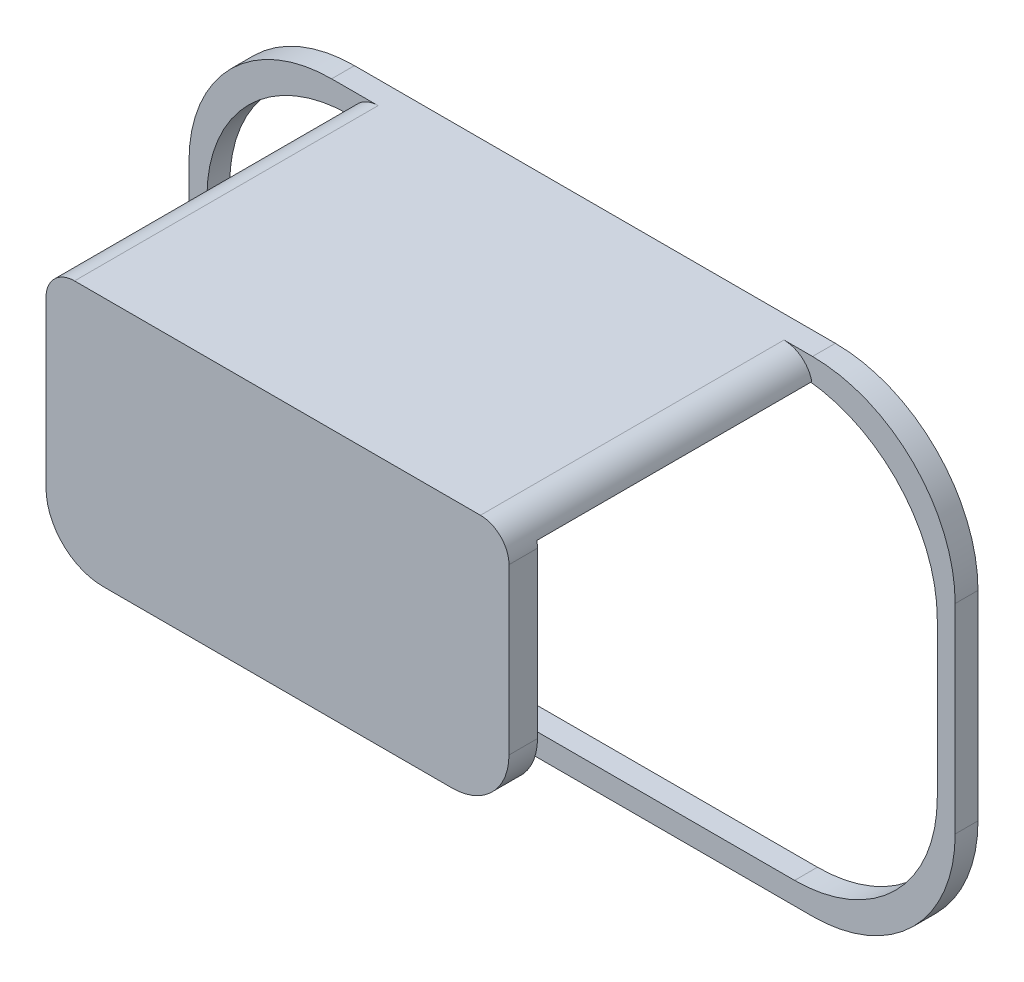
ISO-10303-21;
HEADER;
FILE_DESCRIPTION(('STEP AP214'),'2;1');
FILE_NAME('part.step','',(''),(''),'','','');
FILE_SCHEMA(('AUTOMOTIVE_DESIGN { 1 0 10303 214 1 1 1 1 }'));
ENDSEC;
DATA;
#1=APPLICATION_CONTEXT('core data for automotive mechanical design processes');
#2=APPLICATION_PROTOCOL_DEFINITION('international standard','automotive_design',2000,#1);
#3=PRODUCT_CONTEXT('',#1,'mechanical');
#4=PRODUCT('Part','Part','',(#3));
#5=PRODUCT_RELATED_PRODUCT_CATEGORY('part','',(#4));
#6=PRODUCT_DEFINITION_FORMATION('','',#4);
#7=PRODUCT_DEFINITION_CONTEXT('part definition',#1,'design');
#8=PRODUCT_DEFINITION('design','',#6,#7);
#9=PRODUCT_DEFINITION_SHAPE('','',#8);
#10=(LENGTH_UNIT() NAMED_UNIT(*) SI_UNIT(.MILLI.,.METRE.));
#11=(NAMED_UNIT(*) PLANE_ANGLE_UNIT() SI_UNIT($,.RADIAN.));
#12=(NAMED_UNIT(*) SI_UNIT($,.STERADIAN.) SOLID_ANGLE_UNIT());
#13=UNCERTAINTY_MEASURE_WITH_UNIT(LENGTH_MEASURE(1.E-05),#10,'distance_accuracy_value','');
#14=(GEOMETRIC_REPRESENTATION_CONTEXT(3) GLOBAL_UNCERTAINTY_ASSIGNED_CONTEXT((#13)) GLOBAL_UNIT_ASSIGNED_CONTEXT((#10,
#11,#12)) REPRESENTATION_CONTEXT('',''));
#15=CARTESIAN_POINT('',(0.,0.,0.));
#16=DIRECTION('',(0.,0.,1.));
#17=DIRECTION('',(1.,0.,0.));
#18=AXIS2_PLACEMENT_3D('',#15,#16,#17);
#19=CARTESIAN_POINT('',(0.,36.2044907036284,4.));
#20=DIRECTION('',(0.,1.,0.));
#21=DIRECTION('',(0.,0.,1.));
#22=AXIS2_PLACEMENT_3D('',#19,#20,#21);
#23=PLANE('',#22);
#24=DIRECTION('',(1.,0.,0.));
#25=VECTOR('',#24,1.);
#26=CARTESIAN_POINT('',(0.,36.2044907036284,4.));
#27=LINE('',#26,#25);
#28=CARTESIAN_POINT('',(31.5700564071866,36.2044907036284,4.));
#29=VERTEX_POINT('',#28);
#30=CARTESIAN_POINT('',(34.5868895045628,36.2044907036284,4.));
#31=VERTEX_POINT('',#30);
#32=EDGE_CURVE('E246',#29,#31,#27,.T.);
#33=ORIENTED_EDGE('',*,*,#32,.T.);
#34=DIRECTION('',(0.,0.,-1.));
#35=VECTOR('',#34,1.);
#36=CARTESIAN_POINT('',(34.5868895045628,36.2044907036284,4.));
#37=LINE('',#36,#35);
#38=CARTESIAN_POINT('',(34.5868895045628,36.2044907036284,52.2010552892028));
#39=VERTEX_POINT('',#38);
#40=EDGE_CURVE('E367',#31,#39,#37,.F.);
#41=ORIENTED_EDGE('',*,*,#40,.T.);
#42=DIRECTION('',(1.,0.,0.));
#43=VECTOR('',#42,1.);
#44=CARTESIAN_POINT('',(-46.4299435928134,36.2044907036284,52.2010552892028));
#45=LINE('',#44,#43);
#46=CARTESIAN_POINT('',(-46.3051141870358,36.2044907036284,52.2010552892028));
#47=VERTEX_POINT('',#46);
#48=EDGE_CURVE('E398',#47,#39,#45,.T.);
#49=ORIENTED_EDGE('',*,*,#48,.F.);
#50=DIRECTION('',(0.,0.,-1.));
#51=VECTOR('',#50,1.);
#52=CARTESIAN_POINT('',(-46.3051141870358,36.2044907036284,52.2010552892028));
#53=LINE('',#52,#51);
#54=CARTESIAN_POINT('',(-46.3051141870358,36.2044907036284,4.));
#55=VERTEX_POINT('',#54);
#56=EDGE_CURVE('E362',#47,#55,#53,.T.);
#57=ORIENTED_EDGE('',*,*,#56,.T.);
#58=DIRECTION('',(-1.,0.,0.));
#59=VECTOR('',#58,1.);
#60=CARTESIAN_POINT('',(0.,36.2044907036284,4.));
#61=LINE('',#60,#59);
#62=CARTESIAN_POINT('',(-46.4299435928134,36.2044907036284,4.));
#63=VERTEX_POINT('',#62);
#64=EDGE_CURVE('E365',#55,#63,#61,.T.);
#65=ORIENTED_EDGE('',*,*,#64,.T.);
#66=DIRECTION('',(0.,0.,-1.));
#67=VECTOR('',#66,1.);
#68=CARTESIAN_POINT('',(-46.4299435928134,36.2044907036284,4.));
#69=LINE('',#68,#67);
#70=CARTESIAN_POINT('',(-46.4299435928134,36.2044907036284,0.));
#71=VERTEX_POINT('',#70);
#72=EDGE_CURVE('E296',#63,#71,#69,.T.);
#73=ORIENTED_EDGE('',*,*,#72,.T.);
#74=DIRECTION('',(1.,0.,0.));
#75=VECTOR('',#74,1.);
#76=CARTESIAN_POINT('',(0.,36.2044907036284,0.));
#77=LINE('',#76,#75);
#78=CARTESIAN_POINT('',(31.5700564071866,36.2044907036284,0.));
#79=VERTEX_POINT('',#78);
#80=EDGE_CURVE('E260',#71,#79,#77,.T.);
#81=ORIENTED_EDGE('',*,*,#80,.T.);
#82=DIRECTION('',(0.,0.,-1.));
#83=VECTOR('',#82,1.);
#84=CARTESIAN_POINT('',(31.5700564071866,36.2044907036284,4.));
#85=LINE('',#84,#83);
#86=EDGE_CURVE('E299',#79,#29,#85,.F.);
#87=ORIENTED_EDGE('',*,*,#86,.T.);
#88=EDGE_LOOP('',(#33,#41,#49,#57,#65,#73,#81,#87));
#89=FACE_BOUND('',#88,.T.);
#90=ADVANCED_FACE('F41',(#89),#23,.F.);
#91=CARTESIAN_POINT('',(56.5700564071866,0.,4.));
#92=DIRECTION('',(1.,0.,0.));
#93=DIRECTION('',(0.,0.,-1.));
#94=AXIS2_PLACEMENT_3D('',#91,#92,#93);
#95=PLANE('',#94);
#96=DIRECTION('',(0.,-1.,0.));
#97=VECTOR('',#96,1.);
#98=CARTESIAN_POINT('',(56.5700564071866,0.,0.));
#99=LINE('',#98,#97);
#100=CARTESIAN_POINT('',(56.5700564071866,11.2044907036284,0.));
#101=VERTEX_POINT('',#100);
#102=CARTESIAN_POINT('',(56.5700564071866,-15.9955092963716,0.));
#103=VERTEX_POINT('',#102);
#104=EDGE_CURVE('E263',#101,#103,#99,.T.);
#105=ORIENTED_EDGE('',*,*,#104,.T.);
#106=DIRECTION('',(0.,0.,-1.));
#107=VECTOR('',#106,1.);
#108=CARTESIAN_POINT('',(56.5700564071866,-15.9955092963716,4.));
#109=LINE('',#108,#107);
#110=CARTESIAN_POINT('',(56.5700564071866,-15.9955092963716,4.));
#111=VERTEX_POINT('',#110);
#112=EDGE_CURVE('E294',#103,#111,#109,.F.);
#113=ORIENTED_EDGE('',*,*,#112,.T.);
#114=DIRECTION('',(0.,-1.,0.));
#115=VECTOR('',#114,1.);
#116=CARTESIAN_POINT('',(56.5700564071866,0.,4.));
#117=LINE('',#116,#115);
#118=CARTESIAN_POINT('',(56.5700564071866,11.2044907036284,4.));
#119=VERTEX_POINT('',#118);
#120=EDGE_CURVE('E426',#119,#111,#117,.T.);
#121=ORIENTED_EDGE('',*,*,#120,.F.);
#122=DIRECTION('',(0.,0.,-1.));
#123=VECTOR('',#122,1.);
#124=CARTESIAN_POINT('',(56.5700564071866,11.2044907036284,0.));
#125=LINE('',#124,#123);
#126=EDGE_CURVE('E291',#119,#101,#125,.T.);
#127=ORIENTED_EDGE('',*,*,#126,.T.);
#128=EDGE_LOOP('',(#105,#113,#121,#127));
#129=FACE_BOUND('',#128,.T.);
#130=ADVANCED_FACE('F454',(#129),#95,.F.);
#131=CARTESIAN_POINT('',(0.,-40.9955092963716,4.));
#132=DIRECTION('',(0.,1.,0.));
#133=DIRECTION('',(0.,0.,1.));
#134=AXIS2_PLACEMENT_3D('',#131,#132,#133);
#135=PLANE('',#134);
#136=DIRECTION('',(1.,0.,0.));
#137=VECTOR('',#136,1.);
#138=CARTESIAN_POINT('',(0.,-40.9955092963716,4.));
#139=LINE('',#138,#137);
#140=CARTESIAN_POINT('',(-46.4299435928134,-40.9955092963716,4.));
#141=VERTEX_POINT('',#140);
#142=CARTESIAN_POINT('',(31.5700564071866,-40.9955092963716,4.));
#143=VERTEX_POINT('',#142);
#144=EDGE_CURVE('E428',#141,#143,#139,.T.);
#145=ORIENTED_EDGE('',*,*,#144,.T.);
#146=DIRECTION('',(0.,0.,-1.));
#147=VECTOR('',#146,1.);
#148=CARTESIAN_POINT('',(31.5700564071866,-40.9955092963716,4.));
#149=LINE('',#148,#147);
#150=CARTESIAN_POINT('',(31.5700564071866,-40.9955092963716,0.));
#151=VERTEX_POINT('',#150);
#152=EDGE_CURVE('E288',#143,#151,#149,.T.);
#153=ORIENTED_EDGE('',*,*,#152,.T.);
#154=DIRECTION('',(1.,0.,0.));
#155=VECTOR('',#154,1.);
#156=CARTESIAN_POINT('',(0.,-40.9955092963716,0.));
#157=LINE('',#156,#155);
#158=CARTESIAN_POINT('',(-46.4299435928134,-40.9955092963716,0.));
#159=VERTEX_POINT('',#158);
#160=EDGE_CURVE('E266',#159,#151,#157,.T.);
#161=ORIENTED_EDGE('',*,*,#160,.F.);
#162=DIRECTION('',(0.,0.,-1.));
#163=VECTOR('',#162,1.);
#164=CARTESIAN_POINT('',(-46.4299435928134,-40.9955092963716,4.));
#165=LINE('',#164,#163);
#166=EDGE_CURVE('E286',#159,#141,#165,.F.);
#167=ORIENTED_EDGE('',*,*,#166,.T.);
#168=EDGE_LOOP('',(#145,#153,#161,#167));
#169=FACE_BOUND('',#168,.T.);
#170=ADVANCED_FACE('F447',(#169),#135,.T.);
#171=CARTESIAN_POINT('',(0.,-44.8852338002764,4.));
#172=DIRECTION('',(0.,1.,0.));
#173=DIRECTION('',(-1.,0.,0.));
#174=AXIS2_PLACEMENT_3D('',#171,#172,#173);
#175=PLANE('',#174);
#176=DIRECTION('',(1.,0.,0.));
#177=VECTOR('',#176,1.);
#178=CARTESIAN_POINT('',(0.,-44.8852338002764,4.));
#179=LINE('',#178,#177);
#180=CARTESIAN_POINT('',(-49.5716060959673,-44.8852338002764,4.));
#181=VERTEX_POINT('',#180);
#182=CARTESIAN_POINT('',(34.7117189103404,-44.8852338002764,4.));
#183=VERTEX_POINT('',#182);
#184=EDGE_CURVE('E237',#181,#183,#179,.T.);
#185=ORIENTED_EDGE('',*,*,#184,.F.);
#186=DIRECTION('',(0.,0.,-1.));
#187=VECTOR('',#186,1.);
#188=CARTESIAN_POINT('',(-49.5716060959673,-44.8852338002764,4.));
#189=LINE('',#188,#187);
#190=CARTESIAN_POINT('',(-49.5716060959673,-44.8852338002764,0.));
#191=VERTEX_POINT('',#190);
#192=EDGE_CURVE('E221',#181,#191,#189,.T.);
#193=ORIENTED_EDGE('',*,*,#192,.T.);
#194=DIRECTION('',(1.,0.,0.));
#195=VECTOR('',#194,1.);
#196=CARTESIAN_POINT('',(0.,-44.8852338002764,0.));
#197=LINE('',#196,#195);
#198=CARTESIAN_POINT('',(34.7117189103404,-44.8852338002764,0.));
#199=VERTEX_POINT('',#198);
#200=EDGE_CURVE('E234',#191,#199,#197,.T.);
#201=ORIENTED_EDGE('',*,*,#200,.T.);
#202=DIRECTION('',(0.,0.,-1.));
#203=VECTOR('',#202,1.);
#204=CARTESIAN_POINT('',(34.7117189103404,-44.8852338002764,4.));
#205=LINE('',#204,#203);
#206=EDGE_CURVE('E239',#199,#183,#205,.F.);
#207=ORIENTED_EDGE('',*,*,#206,.T.);
#208=EDGE_LOOP('',(#185,#193,#201,#207));
#209=FACE_BOUND('',#208,.T.);
#210=ADVANCED_FACE('F233',(#209),#175,.F.);
#211=CARTESIAN_POINT('',(59.7117189103404,0.,4.));
#212=DIRECTION('',(1.,0.,0.));
#213=DIRECTION('',(0.,1.,0.));
#214=AXIS2_PLACEMENT_3D('',#211,#212,#213);
#215=PLANE('',#214);
#216=DIRECTION('',(0.,-1.,0.));
#217=VECTOR('',#216,1.);
#218=CARTESIAN_POINT('',(59.7117189103404,0.,0.));
#219=LINE('',#218,#217);
#220=CARTESIAN_POINT('',(59.7117189103404,15.0942152075331,0.));
#221=VERTEX_POINT('',#220);
#222=CARTESIAN_POINT('',(59.7117189103404,-19.8852338002764,0.));
#223=VERTEX_POINT('',#222);
#224=EDGE_CURVE('E245',#221,#223,#219,.T.);
#225=ORIENTED_EDGE('',*,*,#224,.F.);
#226=DIRECTION('',(0.,0.,-1.));
#227=VECTOR('',#226,1.);
#228=CARTESIAN_POINT('',(59.7117189103404,15.0942152075331,4.));
#229=LINE('',#228,#227);
#230=CARTESIAN_POINT('',(59.7117189103404,15.0942152075331,4.));
#231=VERTEX_POINT('',#230);
#232=EDGE_CURVE('E284',#221,#231,#229,.F.);
#233=ORIENTED_EDGE('',*,*,#232,.T.);
#234=DIRECTION('',(0.,-1.,0.));
#235=VECTOR('',#234,1.);
#236=CARTESIAN_POINT('',(59.7117189103404,0.,4.));
#237=LINE('',#236,#235);
#238=CARTESIAN_POINT('',(59.7117189103404,-19.8852338002764,4.));
#239=VERTEX_POINT('',#238);
#240=EDGE_CURVE('E418',#231,#239,#237,.T.);
#241=ORIENTED_EDGE('',*,*,#240,.T.);
#242=DIRECTION('',(0.,0.,-1.));
#243=VECTOR('',#242,1.);
#244=CARTESIAN_POINT('',(59.7117189103404,-19.8852338002764,0.));
#245=LINE('',#244,#243);
#246=EDGE_CURVE('E281',#239,#223,#245,.T.);
#247=ORIENTED_EDGE('',*,*,#246,.T.);
#248=EDGE_LOOP('',(#225,#233,#241,#247));
#249=FACE_BOUND('',#248,.T.);
#250=ADVANCED_FACE('F481',(#249),#215,.T.);
#251=CARTESIAN_POINT('',(0.,40.0942152075331,4.));
#252=DIRECTION('',(0.,1.,0.));
#253=DIRECTION('',(-1.,0.,0.));
#254=AXIS2_PLACEMENT_3D('',#251,#252,#253);
#255=PLANE('',#254);
#256=DIRECTION('',(1.,0.,0.));
#257=VECTOR('',#256,1.);
#258=CARTESIAN_POINT('',(34.7117189103404,40.0942152075331,57.2010552892028));
#259=LINE('',#258,#257);
#260=CARTESIAN_POINT('',(-41.4299435928134,40.0942152075331,57.2010552892028));
#261=VERTEX_POINT('',#260);
#262=CARTESIAN_POINT('',(29.7117189103404,40.0942152075331,57.2010552892028));
#263=VERTEX_POINT('',#262);
#264=EDGE_CURVE('E251',#261,#263,#259,.T.);
#265=ORIENTED_EDGE('',*,*,#264,.T.);
#266=DIRECTION('',(0.,0.,-1.));
#267=VECTOR('',#266,1.);
#268=CARTESIAN_POINT('',(29.7117189103404,40.0942152075331,4.));
#269=LINE('',#268,#267);
#270=CARTESIAN_POINT('',(29.7117189103404,40.0942152075331,4.));
#271=VERTEX_POINT('',#270);
#272=EDGE_CURVE('E359',#263,#271,#269,.T.);
#273=ORIENTED_EDGE('',*,*,#272,.T.);
#274=DIRECTION('',(1.,0.,0.));
#275=VECTOR('',#274,1.);
#276=CARTESIAN_POINT('',(0.,40.0942152075331,4.));
#277=LINE('',#276,#275);
#278=CARTESIAN_POINT('',(34.7117189103404,40.0942152075331,4.));
#279=VERTEX_POINT('',#278);
#280=EDGE_CURVE('E357',#271,#279,#277,.T.);
#281=ORIENTED_EDGE('',*,*,#280,.T.);
#282=DIRECTION('',(0.,0.,-1.));
#283=VECTOR('',#282,1.);
#284=CARTESIAN_POINT('',(34.7117189103404,40.0942152075331,4.));
#285=LINE('',#284,#283);
#286=CARTESIAN_POINT('',(34.7117189103404,40.0942152075331,0.));
#287=VERTEX_POINT('',#286);
#288=EDGE_CURVE('E276',#279,#287,#285,.T.);
#289=ORIENTED_EDGE('',*,*,#288,.T.);
#290=DIRECTION('',(1.,0.,0.));
#291=VECTOR('',#290,1.);
#292=CARTESIAN_POINT('',(0.,40.0942152075331,0.));
#293=LINE('',#292,#291);
#294=CARTESIAN_POINT('',(-49.5716060959673,40.0942152075331,0.));
#295=VERTEX_POINT('',#294);
#296=EDGE_CURVE('E248',#295,#287,#293,.T.);
#297=ORIENTED_EDGE('',*,*,#296,.F.);
#298=DIRECTION('',(0.,0.,-1.));
#299=VECTOR('',#298,1.);
#300=CARTESIAN_POINT('',(-49.5716060959673,40.0942152075331,4.));
#301=LINE('',#300,#299);
#302=CARTESIAN_POINT('',(-49.5716060959673,40.0942152075331,4.));
#303=VERTEX_POINT('',#302);
#304=EDGE_CURVE('E279',#295,#303,#301,.F.);
#305=ORIENTED_EDGE('',*,*,#304,.T.);
#306=DIRECTION('',(1.,0.,0.));
#307=VECTOR('',#306,1.);
#308=CARTESIAN_POINT('',(0.,40.0942152075331,4.));
#309=LINE('',#308,#307);
#310=CARTESIAN_POINT('',(-41.4299435928134,40.0942152075331,4.));
#311=VERTEX_POINT('',#310);
#312=EDGE_CURVE('E421',#303,#311,#309,.T.);
#313=ORIENTED_EDGE('',*,*,#312,.T.);
#314=DIRECTION('',(0.,0.,-1.));
#315=VECTOR('',#314,1.);
#316=CARTESIAN_POINT('',(-41.4299435928134,40.0942152075331,4.));
#317=LINE('',#316,#315);
#318=EDGE_CURVE('E355',#311,#261,#317,.F.);
#319=ORIENTED_EDGE('',*,*,#318,.T.);
#320=EDGE_LOOP('',(#265,#273,#281,#289,#297,#305,#313,#319));
#321=FACE_BOUND('',#320,.T.);
#322=ADVANCED_FACE('F469',(#321),#255,.T.);
#323=CARTESIAN_POINT('',(-74.5716060959673,0.,4.));
#324=DIRECTION('',(1.,0.,0.));
#325=DIRECTION('',(0.,1.,0.));
#326=AXIS2_PLACEMENT_3D('',#323,#324,#325);
#327=PLANE('',#326);
#328=DIRECTION('',(0.,-1.,0.));
#329=VECTOR('',#328,1.);
#330=CARTESIAN_POINT('',(-74.5716060959673,0.,0.));
#331=LINE('',#330,#329);
#332=CARTESIAN_POINT('',(-74.5716060959673,15.0942152075331,0.));
#333=VERTEX_POINT('',#332);
#334=CARTESIAN_POINT('',(-74.5716060959673,-19.8852338002764,0.));
#335=VERTEX_POINT('',#334);
#336=EDGE_CURVE('E258',#333,#335,#331,.T.);
#337=ORIENTED_EDGE('',*,*,#336,.T.);
#338=DIRECTION('',(0.,0.,-1.));
#339=VECTOR('',#338,1.);
#340=CARTESIAN_POINT('',(-74.5716060959673,-19.8852338002764,4.));
#341=LINE('',#340,#339);
#342=CARTESIAN_POINT('',(-74.5716060959673,-19.8852338002764,4.));
#343=VERTEX_POINT('',#342);
#344=EDGE_CURVE('E222',#335,#343,#341,.F.);
#345=ORIENTED_EDGE('',*,*,#344,.T.);
#346=DIRECTION('',(0.,-1.,0.));
#347=VECTOR('',#346,1.);
#348=CARTESIAN_POINT('',(-74.5716060959673,0.,4.));
#349=LINE('',#348,#347);
#350=CARTESIAN_POINT('',(-74.5716060959673,15.0942152075331,4.));
#351=VERTEX_POINT('',#350);
#352=EDGE_CURVE('E423',#351,#343,#349,.T.);
#353=ORIENTED_EDGE('',*,*,#352,.F.);
#354=DIRECTION('',(0.,0.,-1.));
#355=VECTOR('',#354,1.);
#356=CARTESIAN_POINT('',(-74.5716060959673,15.0942152075331,0.));
#357=LINE('',#356,#355);
#358=EDGE_CURVE('E238',#351,#333,#357,.T.);
#359=ORIENTED_EDGE('',*,*,#358,.T.);
#360=EDGE_LOOP('',(#337,#345,#353,#359));
#361=FACE_BOUND('',#360,.T.);
#362=ADVANCED_FACE('F490',(#361),#327,.F.);
#363=CARTESIAN_POINT('',(-71.4299435928134,0.,4.));
#364=DIRECTION('',(1.,0.,0.));
#365=DIRECTION('',(0.,1.,0.));
#366=AXIS2_PLACEMENT_3D('',#363,#364,#365);
#367=PLANE('',#366);
#368=DIRECTION('',(0.,-1.,0.));
#369=VECTOR('',#368,1.);
#370=CARTESIAN_POINT('',(-71.4299435928134,0.,4.));
#371=LINE('',#370,#369);
#372=CARTESIAN_POINT('',(-71.4299435928134,11.2044907036284,4.));
#373=VERTEX_POINT('',#372);
#374=CARTESIAN_POINT('',(-71.4299435928134,-15.9955092963716,4.));
#375=VERTEX_POINT('',#374);
#376=EDGE_CURVE('E254',#373,#375,#371,.T.);
#377=ORIENTED_EDGE('',*,*,#376,.T.);
#378=DIRECTION('',(0.,0.,-1.));
#379=VECTOR('',#378,1.);
#380=CARTESIAN_POINT('',(-71.4299435928134,-15.9955092963716,0.));
#381=LINE('',#380,#379);
#382=CARTESIAN_POINT('',(-71.4299435928134,-15.9955092963716,0.));
#383=VERTEX_POINT('',#382);
#384=EDGE_CURVE('E304',#375,#383,#381,.T.);
#385=ORIENTED_EDGE('',*,*,#384,.T.);
#386=DIRECTION('',(0.,-1.,0.));
#387=VECTOR('',#386,1.);
#388=CARTESIAN_POINT('',(-71.4299435928134,0.,0.));
#389=LINE('',#388,#387);
#390=CARTESIAN_POINT('',(-71.4299435928134,11.2044907036284,0.));
#391=VERTEX_POINT('',#390);
#392=EDGE_CURVE('E269',#391,#383,#389,.T.);
#393=ORIENTED_EDGE('',*,*,#392,.F.);
#394=DIRECTION('',(0.,0.,-1.));
#395=VECTOR('',#394,1.);
#396=CARTESIAN_POINT('',(-71.4299435928134,11.2044907036284,4.));
#397=LINE('',#396,#395);
#398=EDGE_CURVE('E302',#391,#373,#397,.F.);
#399=ORIENTED_EDGE('',*,*,#398,.T.);
#400=EDGE_LOOP('',(#377,#385,#393,#399));
#401=FACE_BOUND('',#400,.T.);
#402=ADVANCED_FACE('F437',(#401),#367,.T.);
#403=CARTESIAN_POINT('',(0.,0.,4.));
#404=DIRECTION('',(0.,0.,1.));
#405=DIRECTION('',(1.,0.,0.));
#406=AXIS2_PLACEMENT_3D('',#403,#404,#405);
#407=PLANE('',#406);
#408=CARTESIAN_POINT('',(-46.4299435928134,11.2044907036284,4.));
#409=DIRECTION('',(0.,0.,1.));
#410=DIRECTION('',(1.,0.,0.));
#411=AXIS2_PLACEMENT_3D('',#408,#409,#410);
#412=CIRCLE('',#411,25.);
#413=EDGE_CURVE('E321',#373,#63,#412,.F.);
#414=ORIENTED_EDGE('',*,*,#413,.T.);
#415=ORIENTED_EDGE('',*,*,#64,.F.);
#416=CARTESIAN_POINT('',(-41.4299435928134,35.0942152075331,4.));
#417=DIRECTION('',(0.,0.,1.));
#418=DIRECTION('',(1.,0.,0.));
#419=AXIS2_PLACEMENT_3D('',#416,#417,#418);
#420=CIRCLE('',#419,5.);
#421=EDGE_CURVE('E11',#55,#311,#420,.F.);
#422=ORIENTED_EDGE('',*,*,#421,.T.);
#423=ORIENTED_EDGE('',*,*,#312,.F.);
#424=CARTESIAN_POINT('',(-49.5716060959673,15.0942152075331,4.));
#425=DIRECTION('',(0.,0.,1.));
#426=DIRECTION('',(1.,0.,0.));
#427=AXIS2_PLACEMENT_3D('',#424,#425,#426);
#428=CIRCLE('',#427,25.);
#429=EDGE_CURVE('E332',#303,#351,#428,.T.);
#430=ORIENTED_EDGE('',*,*,#429,.T.);
#431=ORIENTED_EDGE('',*,*,#352,.T.);
#432=CARTESIAN_POINT('',(-49.5716060959673,-19.8852338002764,4.));
#433=DIRECTION('',(0.,0.,1.));
#434=DIRECTION('',(1.,0.,0.));
#435=AXIS2_PLACEMENT_3D('',#432,#433,#434);
#436=CIRCLE('',#435,25.);
#437=EDGE_CURVE('E334',#343,#181,#436,.T.);
#438=ORIENTED_EDGE('',*,*,#437,.T.);
#439=ORIENTED_EDGE('',*,*,#184,.T.);
#440=CARTESIAN_POINT('',(34.7117189103404,-19.8852338002764,4.));
#441=DIRECTION('',(0.,0.,1.));
#442=DIRECTION('',(1.,0.,0.));
#443=AXIS2_PLACEMENT_3D('',#440,#441,#442);
#444=CIRCLE('',#443,25.);
#445=EDGE_CURVE('E227',#183,#239,#444,.T.);
#446=ORIENTED_EDGE('',*,*,#445,.T.);
#447=ORIENTED_EDGE('',*,*,#240,.F.);
#448=CARTESIAN_POINT('',(34.7117189103404,15.0942152075331,4.));
#449=DIRECTION('',(0.,0.,1.));
#450=DIRECTION('',(1.,0.,0.));
#451=AXIS2_PLACEMENT_3D('',#448,#449,#450);
#452=CIRCLE('',#451,25.);
#453=EDGE_CURVE('E329',#231,#279,#452,.T.);
#454=ORIENTED_EDGE('',*,*,#453,.T.);
#455=ORIENTED_EDGE('',*,*,#280,.F.);
#456=CARTESIAN_POINT('',(29.7117189103404,35.0942152075331,4.));
#457=DIRECTION('',(0.,0.,1.));
#458=DIRECTION('',(1.,0.,0.));
#459=AXIS2_PLACEMENT_3D('',#456,#457,#458);
#460=CIRCLE('',#459,5.);
#461=EDGE_CURVE('E49',#271,#31,#460,.F.);
#462=ORIENTED_EDGE('',*,*,#461,.T.);
#463=ORIENTED_EDGE('',*,*,#32,.F.);
#464=CARTESIAN_POINT('',(31.5700564071866,11.2044907036284,4.));
#465=DIRECTION('',(0.,0.,1.));
#466=DIRECTION('',(1.,0.,0.));
#467=AXIS2_PLACEMENT_3D('',#464,#465,#466);
#468=CIRCLE('',#467,25.);
#469=EDGE_CURVE('E313',#29,#119,#468,.F.);
#470=ORIENTED_EDGE('',*,*,#469,.T.);
#471=ORIENTED_EDGE('',*,*,#120,.T.);
#472=CARTESIAN_POINT('',(31.5700564071866,-15.9955092963716,4.));
#473=DIRECTION('',(0.,0.,1.));
#474=DIRECTION('',(1.,0.,0.));
#475=AXIS2_PLACEMENT_3D('',#472,#473,#474);
#476=CIRCLE('',#475,25.);
#477=EDGE_CURVE('E309',#111,#143,#476,.F.);
#478=ORIENTED_EDGE('',*,*,#477,.T.);
#479=ORIENTED_EDGE('',*,*,#144,.F.);
#480=CARTESIAN_POINT('',(-46.4299435928134,-15.9955092963716,4.));
#481=DIRECTION('',(0.,0.,1.));
#482=DIRECTION('',(1.,0.,0.));
#483=AXIS2_PLACEMENT_3D('',#480,#481,#482);
#484=CIRCLE('',#483,25.);
#485=EDGE_CURVE('E317',#141,#375,#484,.F.);
#486=ORIENTED_EDGE('',*,*,#485,.T.);
#487=ORIENTED_EDGE('',*,*,#376,.F.);
#488=EDGE_LOOP('',(#414,#415,#422,#423,#430,#431,#438,#439,#446,#447,#454,#455,#462,#463,#470,
#471,#478,#479,#486,#487));
#489=FACE_BOUND('',#488,.T.);
#490=ADVANCED_FACE('F381',(#489),#407,.T.);
#491=CARTESIAN_POINT('',(0.,0.,0.));
#492=DIRECTION('',(0.,0.,1.));
#493=DIRECTION('',(1.,0.,0.));
#494=AXIS2_PLACEMENT_3D('',#491,#492,#493);
#495=PLANE('',#494);
#496=ORIENTED_EDGE('',*,*,#296,.T.);
#497=CARTESIAN_POINT('',(34.7117189103404,15.0942152075331,0.));
#498=DIRECTION('',(0.,0.,1.));
#499=DIRECTION('',(1.,0.,0.));
#500=AXIS2_PLACEMENT_3D('',#497,#498,#499);
#501=CIRCLE('',#500,25.);
#502=EDGE_CURVE('E325',#287,#221,#501,.F.);
#503=ORIENTED_EDGE('',*,*,#502,.T.);
#504=ORIENTED_EDGE('',*,*,#224,.T.);
#505=CARTESIAN_POINT('',(34.7117189103404,-19.8852338002764,0.));
#506=DIRECTION('',(0.,0.,1.));
#507=DIRECTION('',(1.,0.,0.));
#508=AXIS2_PLACEMENT_3D('',#505,#506,#507);
#509=CIRCLE('',#508,25.);
#510=EDGE_CURVE('E244',#223,#199,#509,.F.);
#511=ORIENTED_EDGE('',*,*,#510,.T.);
#512=ORIENTED_EDGE('',*,*,#200,.F.);
#513=CARTESIAN_POINT('',(-49.5716060959673,-19.8852338002764,0.));
#514=DIRECTION('',(0.,0.,1.));
#515=DIRECTION('',(1.,0.,0.));
#516=AXIS2_PLACEMENT_3D('',#513,#514,#515);
#517=CIRCLE('',#516,25.);
#518=EDGE_CURVE('E217',#191,#335,#517,.F.);
#519=ORIENTED_EDGE('',*,*,#518,.T.);
#520=ORIENTED_EDGE('',*,*,#336,.F.);
#521=CARTESIAN_POINT('',(-49.5716060959673,15.0942152075331,0.));
#522=DIRECTION('',(0.,0.,1.));
#523=DIRECTION('',(1.,0.,0.));
#524=AXIS2_PLACEMENT_3D('',#521,#522,#523);
#525=CIRCLE('',#524,25.);
#526=EDGE_CURVE('E228',#333,#295,#525,.F.);
#527=ORIENTED_EDGE('',*,*,#526,.T.);
#528=EDGE_LOOP('',(#496,#503,#504,#511,#512,#519,#520,#527));
#529=FACE_BOUND('',#528,.T.);
#530=ORIENTED_EDGE('',*,*,#80,.F.);
#531=CARTESIAN_POINT('',(-46.4299435928134,11.2044907036284,0.));
#532=DIRECTION('',(0.,0.,1.));
#533=DIRECTION('',(1.,0.,0.));
#534=AXIS2_PLACEMENT_3D('',#531,#532,#533);
#535=CIRCLE('',#534,25.);
#536=EDGE_CURVE('E319',#71,#391,#535,.T.);
#537=ORIENTED_EDGE('',*,*,#536,.T.);
#538=ORIENTED_EDGE('',*,*,#392,.T.);
#539=CARTESIAN_POINT('',(-46.4299435928134,-15.9955092963716,0.));
#540=DIRECTION('',(0.,0.,1.));
#541=DIRECTION('',(1.,0.,0.));
#542=AXIS2_PLACEMENT_3D('',#539,#540,#541);
#543=CIRCLE('',#542,25.);
#544=EDGE_CURVE('E315',#383,#159,#543,.T.);
#545=ORIENTED_EDGE('',*,*,#544,.T.);
#546=ORIENTED_EDGE('',*,*,#160,.T.);
#547=CARTESIAN_POINT('',(31.5700564071866,-15.9955092963716,0.));
#548=DIRECTION('',(0.,0.,1.));
#549=DIRECTION('',(1.,0.,0.));
#550=AXIS2_PLACEMENT_3D('',#547,#548,#549);
#551=CIRCLE('',#550,25.);
#552=EDGE_CURVE('E307',#151,#103,#551,.T.);
#553=ORIENTED_EDGE('',*,*,#552,.T.);
#554=ORIENTED_EDGE('',*,*,#104,.F.);
#555=CARTESIAN_POINT('',(31.5700564071866,11.2044907036284,0.));
#556=DIRECTION('',(0.,0.,1.));
#557=DIRECTION('',(1.,0.,0.));
#558=AXIS2_PLACEMENT_3D('',#555,#556,#557);
#559=CIRCLE('',#558,25.);
#560=EDGE_CURVE('E311',#101,#79,#559,.T.);
#561=ORIENTED_EDGE('',*,*,#560,.T.);
#562=EDGE_LOOP('',(#530,#537,#538,#545,#546,#553,#554,#561));
#563=FACE_BOUND('',#562,.T.);
#564=ADVANCED_FACE('F241',(#529,#563),#495,.F.);
#565=CARTESIAN_POINT('',(-49.5716060959673,-19.8852338002764,4.));
#566=DIRECTION('',(0.,0.,-1.));
#567=DIRECTION('',(-1.,0.,0.));
#568=AXIS2_PLACEMENT_3D('',#565,#566,#567);
#569=CYLINDRICAL_SURFACE('',#568,25.);
#570=ORIENTED_EDGE('',*,*,#437,.F.);
#571=ORIENTED_EDGE('',*,*,#344,.F.);
#572=ORIENTED_EDGE('',*,*,#518,.F.);
#573=ORIENTED_EDGE('',*,*,#192,.F.);
#574=EDGE_LOOP('',(#570,#571,#572,#573));
#575=FACE_BOUND('',#574,.T.);
#576=ADVANCED_FACE('F220',(#575),#569,.T.);
#577=CARTESIAN_POINT('',(-49.5716060959673,15.0942152075331,4.));
#578=DIRECTION('',(0.,0.,1.));
#579=DIRECTION('',(1.,0.,0.));
#580=AXIS2_PLACEMENT_3D('',#577,#578,#579);
#581=CYLINDRICAL_SURFACE('',#580,25.);
#582=ORIENTED_EDGE('',*,*,#429,.F.);
#583=ORIENTED_EDGE('',*,*,#304,.F.);
#584=ORIENTED_EDGE('',*,*,#526,.F.);
#585=ORIENTED_EDGE('',*,*,#358,.F.);
#586=EDGE_LOOP('',(#582,#583,#584,#585));
#587=FACE_BOUND('',#586,.T.);
#588=ADVANCED_FACE('F492',(#587),#581,.T.);
#589=CARTESIAN_POINT('',(34.7117189103404,15.0942152075331,4.));
#590=DIRECTION('',(0.,0.,-1.));
#591=DIRECTION('',(-1.,0.,0.));
#592=AXIS2_PLACEMENT_3D('',#589,#590,#591);
#593=CYLINDRICAL_SURFACE('',#592,25.);
#594=ORIENTED_EDGE('',*,*,#453,.F.);
#595=ORIENTED_EDGE('',*,*,#232,.F.);
#596=ORIENTED_EDGE('',*,*,#502,.F.);
#597=ORIENTED_EDGE('',*,*,#288,.F.);
#598=EDGE_LOOP('',(#594,#595,#596,#597));
#599=FACE_BOUND('',#598,.T.);
#600=ADVANCED_FACE('F478',(#599),#593,.T.);
#601=CARTESIAN_POINT('',(34.7117189103404,-19.8852338002764,4.));
#602=DIRECTION('',(0.,0.,1.));
#603=DIRECTION('',(1.,0.,0.));
#604=AXIS2_PLACEMENT_3D('',#601,#602,#603);
#605=CYLINDRICAL_SURFACE('',#604,25.);
#606=ORIENTED_EDGE('',*,*,#445,.F.);
#607=ORIENTED_EDGE('',*,*,#206,.F.);
#608=ORIENTED_EDGE('',*,*,#510,.F.);
#609=ORIENTED_EDGE('',*,*,#246,.F.);
#610=EDGE_LOOP('',(#606,#607,#608,#609));
#611=FACE_BOUND('',#610,.T.);
#612=ADVANCED_FACE('F485',(#611),#605,.T.);
#613=CARTESIAN_POINT('',(31.5700564071866,-15.9955092963716,4.));
#614=DIRECTION('',(0.,0.,-1.));
#615=DIRECTION('',(-1.,0.,0.));
#616=AXIS2_PLACEMENT_3D('',#613,#614,#615);
#617=CYLINDRICAL_SURFACE('',#616,25.);
#618=ORIENTED_EDGE('',*,*,#477,.F.);
#619=ORIENTED_EDGE('',*,*,#112,.F.);
#620=ORIENTED_EDGE('',*,*,#552,.F.);
#621=ORIENTED_EDGE('',*,*,#152,.F.);
#622=EDGE_LOOP('',(#618,#619,#620,#621));
#623=FACE_BOUND('',#622,.T.);
#624=ADVANCED_FACE('F450',(#623),#617,.F.);
#625=CARTESIAN_POINT('',(31.5700564071866,11.2044907036284,4.));
#626=DIRECTION('',(0.,0.,1.));
#627=DIRECTION('',(1.,0.,0.));
#628=AXIS2_PLACEMENT_3D('',#625,#626,#627);
#629=CYLINDRICAL_SURFACE('',#628,25.);
#630=ORIENTED_EDGE('',*,*,#469,.F.);
#631=ORIENTED_EDGE('',*,*,#86,.F.);
#632=ORIENTED_EDGE('',*,*,#560,.F.);
#633=ORIENTED_EDGE('',*,*,#126,.F.);
#634=EDGE_LOOP('',(#630,#631,#632,#633));
#635=FACE_BOUND('',#634,.T.);
#636=ADVANCED_FACE('F458',(#635),#629,.F.);
#637=CARTESIAN_POINT('',(-46.4299435928134,-15.9955092963716,4.));
#638=DIRECTION('',(0.,0.,1.));
#639=DIRECTION('',(1.,0.,0.));
#640=AXIS2_PLACEMENT_3D('',#637,#638,#639);
#641=CYLINDRICAL_SURFACE('',#640,25.);
#642=ORIENTED_EDGE('',*,*,#485,.F.);
#643=ORIENTED_EDGE('',*,*,#166,.F.);
#644=ORIENTED_EDGE('',*,*,#544,.F.);
#645=ORIENTED_EDGE('',*,*,#384,.F.);
#646=EDGE_LOOP('',(#642,#643,#644,#645));
#647=FACE_BOUND('',#646,.T.);
#648=ADVANCED_FACE('F443',(#647),#641,.F.);
#649=CARTESIAN_POINT('',(-46.4299435928134,11.2044907036284,4.));
#650=DIRECTION('',(0.,0.,-1.));
#651=DIRECTION('',(-1.,0.,0.));
#652=AXIS2_PLACEMENT_3D('',#649,#650,#651);
#653=CYLINDRICAL_SURFACE('',#652,25.);
#654=ORIENTED_EDGE('',*,*,#413,.F.);
#655=ORIENTED_EDGE('',*,*,#398,.F.);
#656=ORIENTED_EDGE('',*,*,#536,.F.);
#657=ORIENTED_EDGE('',*,*,#72,.F.);
#658=EDGE_LOOP('',(#654,#655,#656,#657));
#659=FACE_BOUND('',#658,.T.);
#660=ADVANCED_FACE('F461',(#659),#653,.F.);
#661=CARTESIAN_POINT('',(34.7117189103404,40.0942152075331,57.2010552892028));
#662=DIRECTION('',(1.,0.,0.));
#663=DIRECTION('',(0.,0.,-1.));
#664=AXIS2_PLACEMENT_3D('',#661,#662,#663);
#665=PLANE('',#664);
#666=DIRECTION('',(0.,1.,0.));
#667=VECTOR('',#666,1.);
#668=CARTESIAN_POINT('',(34.7117189103404,-3.79550929637161,52.2010552892028));
#669=LINE('',#668,#667);
#670=CARTESIAN_POINT('',(34.7117189103404,6.20449070362839,52.2010552892028));
#671=VERTEX_POINT('',#670);
#672=CARTESIAN_POINT('',(34.7117189103404,35.0942152075331,52.2010552892028));
#673=VERTEX_POINT('',#672);
#674=EDGE_CURVE('E396',#671,#673,#669,.T.);
#675=ORIENTED_EDGE('',*,*,#674,.T.);
#676=DIRECTION('',(0.,0.,-1.));
#677=VECTOR('',#676,1.);
#678=CARTESIAN_POINT('',(34.7117189103404,35.0942152075331,57.2010552892028));
#679=LINE('',#678,#677);
#680=CARTESIAN_POINT('',(34.7117189103404,35.0942152075331,57.2010552892028));
#681=VERTEX_POINT('',#680);
#682=EDGE_CURVE('E64',#673,#681,#679,.F.);
#683=ORIENTED_EDGE('',*,*,#682,.T.);
#684=DIRECTION('',(0.,-1.,0.));
#685=VECTOR('',#684,1.);
#686=CARTESIAN_POINT('',(34.7117189103404,40.0942152075331,57.2010552892028));
#687=LINE('',#686,#685);
#688=CARTESIAN_POINT('',(34.7117189103404,6.20449070362839,57.2010552892028));
#689=VERTEX_POINT('',#688);
#690=EDGE_CURVE('E405',#681,#689,#687,.T.);
#691=ORIENTED_EDGE('',*,*,#690,.T.);
#692=DIRECTION('',(0.,0.,1.));
#693=VECTOR('',#692,1.);
#694=CARTESIAN_POINT('',(34.7117189103404,6.20449070362839,57.2010552892028));
#695=LINE('',#694,#693);
#696=EDGE_CURVE('E353',#689,#671,#695,.F.);
#697=ORIENTED_EDGE('',*,*,#696,.T.);
#698=EDGE_LOOP('',(#675,#683,#691,#697));
#699=FACE_BOUND('',#698,.T.);
#700=ADVANCED_FACE('F399',(#699),#665,.T.);
#701=CARTESIAN_POINT('',(-46.4299435928134,40.0942152075331,57.2010552892028));
#702=DIRECTION('',(-1.,0.,0.));
#703=DIRECTION('',(0.,-1.,0.));
#704=AXIS2_PLACEMENT_3D('',#701,#702,#703);
#705=PLANE('',#704);
#706=DIRECTION('',(0.,1.,0.));
#707=VECTOR('',#706,1.);
#708=CARTESIAN_POINT('',(-46.4299435928134,40.0942152075331,57.2010552892028));
#709=LINE('',#708,#707);
#710=CARTESIAN_POINT('',(-46.4299435928135,6.20449070362841,57.2010552892028));
#711=VERTEX_POINT('',#710);
#712=CARTESIAN_POINT('',(-46.4299435928134,35.0942152075331,57.2010552892028));
#713=VERTEX_POINT('',#712);
#714=EDGE_CURVE('E413',#711,#713,#709,.T.);
#715=ORIENTED_EDGE('',*,*,#714,.T.);
#716=DIRECTION('',(0.,0.,-1.));
#717=VECTOR('',#716,1.);
#718=CARTESIAN_POINT('',(-46.4299435928134,35.0942152075331,57.2010552892028));
#719=LINE('',#718,#717);
#720=CARTESIAN_POINT('',(-46.4299435928134,35.0942152075331,52.2010552892028));
#721=VERTEX_POINT('',#720);
#722=EDGE_CURVE('E377',#713,#721,#719,.T.);
#723=ORIENTED_EDGE('',*,*,#722,.T.);
#724=DIRECTION('',(0.,1.,0.));
#725=VECTOR('',#724,1.);
#726=CARTESIAN_POINT('',(-46.4299435928134,-3.79550929637161,52.2010552892028));
#727=LINE('',#726,#725);
#728=CARTESIAN_POINT('',(-46.4299435928134,6.20449070362841,52.2010552892028));
#729=VERTEX_POINT('',#728);
#730=EDGE_CURVE('E401',#729,#721,#727,.T.);
#731=ORIENTED_EDGE('',*,*,#730,.F.);
#732=DIRECTION('',(0.,0.,-1.));
#733=VECTOR('',#732,1.);
#734=CARTESIAN_POINT('',(-46.4299435928135,6.20449070362841,57.2010552892028));
#735=LINE('',#734,#733);
#736=EDGE_CURVE('E346',#729,#711,#735,.F.);
#737=ORIENTED_EDGE('',*,*,#736,.T.);
#738=EDGE_LOOP('',(#715,#723,#731,#737));
#739=FACE_BOUND('',#738,.T.);
#740=ADVANCED_FACE('F531',(#739),#705,.T.);
#741=CARTESIAN_POINT('',(0.,0.,57.2010552892028));
#742=DIRECTION('',(0.,0.,-1.));
#743=DIRECTION('',(-1.,0.,0.));
#744=AXIS2_PLACEMENT_3D('',#741,#742,#743);
#745=PLANE('',#744);
#746=ORIENTED_EDGE('',*,*,#690,.F.);
#747=CARTESIAN_POINT('',(29.7117189103404,35.0942152075331,57.2010552892028));
#748=DIRECTION('',(0.,0.,-1.));
#749=DIRECTION('',(-1.,0.,0.));
#750=AXIS2_PLACEMENT_3D('',#747,#748,#749);
#751=CIRCLE('',#750,5.);
#752=EDGE_CURVE('E375',#681,#263,#751,.F.);
#753=ORIENTED_EDGE('',*,*,#752,.T.);
#754=ORIENTED_EDGE('',*,*,#264,.F.);
#755=CARTESIAN_POINT('',(-41.4299435928134,35.0942152075331,57.2010552892028));
#756=DIRECTION('',(0.,0.,-1.));
#757=DIRECTION('',(-1.,0.,0.));
#758=AXIS2_PLACEMENT_3D('',#755,#756,#757);
#759=CIRCLE('',#758,5.);
#760=EDGE_CURVE('E56',#261,#713,#759,.F.);
#761=ORIENTED_EDGE('',*,*,#760,.T.);
#762=ORIENTED_EDGE('',*,*,#714,.F.);
#763=CARTESIAN_POINT('',(-36.4299435928135,6.20449070362839,57.2010552892028));
#764=DIRECTION('',(0.,0.,-1.));
#765=DIRECTION('',(-1.,0.,0.));
#766=AXIS2_PLACEMENT_3D('',#763,#764,#765);
#767=CIRCLE('',#766,10.);
#768=CARTESIAN_POINT('',(-36.4299435928135,-3.79550929637161,57.2010552892028));
#769=VERTEX_POINT('',#768);
#770=EDGE_CURVE('E351',#711,#769,#767,.F.);
#771=ORIENTED_EDGE('',*,*,#770,.T.);
#772=DIRECTION('',(-1.,0.,0.));
#773=VECTOR('',#772,1.);
#774=CARTESIAN_POINT('',(-46.4299435928134,-3.79550929637161,57.2010552892028));
#775=LINE('',#774,#773);
#776=CARTESIAN_POINT('',(24.7117189103404,-3.79550929637161,57.2010552892028));
#777=VERTEX_POINT('',#776);
#778=EDGE_CURVE('E402',#777,#769,#775,.T.);
#779=ORIENTED_EDGE('',*,*,#778,.F.);
#780=CARTESIAN_POINT('',(24.7117189103404,6.20449070362839,57.2010552892028));
#781=DIRECTION('',(0.,0.,-1.));
#782=DIRECTION('',(-1.,0.,0.));
#783=AXIS2_PLACEMENT_3D('',#780,#781,#782);
#784=CIRCLE('',#783,10.);
#785=EDGE_CURVE('E348',#777,#689,#784,.F.);
#786=ORIENTED_EDGE('',*,*,#785,.T.);
#787=EDGE_LOOP('',(#746,#753,#754,#761,#762,#771,#779,#786));
#788=FACE_BOUND('',#787,.T.);
#789=ADVANCED_FACE('F470',(#788),#745,.F.);
#790=CARTESIAN_POINT('',(-46.4299435928134,-3.79550929637161,52.2010552892028));
#791=DIRECTION('',(0.,0.,1.));
#792=DIRECTION('',(1.,0.,0.));
#793=AXIS2_PLACEMENT_3D('',#790,#791,#792);
#794=PLANE('',#793);
#795=ORIENTED_EDGE('',*,*,#48,.T.);
#796=CARTESIAN_POINT('',(29.7117189103404,35.0942152075331,52.2010552892028));
#797=DIRECTION('',(0.,0.,1.));
#798=DIRECTION('',(1.,0.,0.));
#799=AXIS2_PLACEMENT_3D('',#796,#797,#798);
#800=CIRCLE('',#799,5.);
#801=EDGE_CURVE('E371',#39,#673,#800,.F.);
#802=ORIENTED_EDGE('',*,*,#801,.T.);
#803=ORIENTED_EDGE('',*,*,#674,.F.);
#804=CARTESIAN_POINT('',(24.7117189103404,6.20449070362839,52.2010552892028));
#805=DIRECTION('',(0.,0.,1.));
#806=DIRECTION('',(1.,0.,0.));
#807=AXIS2_PLACEMENT_3D('',#804,#805,#806);
#808=CIRCLE('',#807,10.);
#809=CARTESIAN_POINT('',(24.7117189103404,-3.79550929637161,52.2010552892028));
#810=VERTEX_POINT('',#809);
#811=EDGE_CURVE('E342',#671,#810,#808,.F.);
#812=ORIENTED_EDGE('',*,*,#811,.T.);
#813=DIRECTION('',(1.,0.,0.));
#814=VECTOR('',#813,1.);
#815=CARTESIAN_POINT('',(-46.4299435928134,-3.79550929637161,52.2010552892028));
#816=LINE('',#815,#814);
#817=CARTESIAN_POINT('',(-36.4299435928135,-3.79550929637161,52.2010552892028));
#818=VERTEX_POINT('',#817);
#819=EDGE_CURVE('E408',#818,#810,#816,.T.);
#820=ORIENTED_EDGE('',*,*,#819,.F.);
#821=CARTESIAN_POINT('',(-36.4299435928135,6.20449070362839,52.2010552892028));
#822=DIRECTION('',(0.,0.,1.));
#823=DIRECTION('',(1.,0.,0.));
#824=AXIS2_PLACEMENT_3D('',#821,#822,#823);
#825=CIRCLE('',#824,10.);
#826=EDGE_CURVE('E344',#818,#729,#825,.F.);
#827=ORIENTED_EDGE('',*,*,#826,.T.);
#828=ORIENTED_EDGE('',*,*,#730,.T.);
#829=CARTESIAN_POINT('',(-41.4299435928134,35.0942152075331,52.2010552892028));
#830=DIRECTION('',(0.,0.,1.));
#831=DIRECTION('',(1.,0.,0.));
#832=AXIS2_PLACEMENT_3D('',#829,#830,#831);
#833=CIRCLE('',#832,5.);
#834=EDGE_CURVE('E369',#721,#47,#833,.F.);
#835=ORIENTED_EDGE('',*,*,#834,.T.);
#836=EDGE_LOOP('',(#795,#802,#803,#812,#820,#827,#828,#835));
#837=FACE_BOUND('',#836,.T.);
#838=ADVANCED_FACE('F395',(#837),#794,.F.);
#839=CARTESIAN_POINT('',(0.,-3.79550929637161,0.));
#840=DIRECTION('',(0.,-1.,0.));
#841=DIRECTION('',(0.,0.,-1.));
#842=AXIS2_PLACEMENT_3D('',#839,#840,#841);
#843=PLANE('',#842);
#844=ORIENTED_EDGE('',*,*,#778,.T.);
#845=DIRECTION('',(0.,0.,-1.));
#846=VECTOR('',#845,1.);
#847=CARTESIAN_POINT('',(-36.4299435928135,-3.79550929637161,0.));
#848=LINE('',#847,#846);
#849=EDGE_CURVE('E339',#769,#818,#848,.T.);
#850=ORIENTED_EDGE('',*,*,#849,.T.);
#851=ORIENTED_EDGE('',*,*,#819,.T.);
#852=DIRECTION('',(0.,0.,1.));
#853=VECTOR('',#852,1.);
#854=CARTESIAN_POINT('',(24.7117189103404,-3.79550929637161,0.));
#855=LINE('',#854,#853);
#856=EDGE_CURVE('E336',#810,#777,#855,.T.);
#857=ORIENTED_EDGE('',*,*,#856,.T.);
#858=EDGE_LOOP('',(#844,#850,#851,#857));
#859=FACE_BOUND('',#858,.T.);
#860=ADVANCED_FACE('F539',(#859),#843,.T.);
#861=CARTESIAN_POINT('',(-36.4299435928135,6.20449070362839,0.));
#862=DIRECTION('',(0.,0.,-1.));
#863=DIRECTION('',(-1.,0.,0.));
#864=AXIS2_PLACEMENT_3D('',#861,#862,#863);
#865=CYLINDRICAL_SURFACE('',#864,10.);
#866=ORIENTED_EDGE('',*,*,#770,.F.);
#867=ORIENTED_EDGE('',*,*,#736,.F.);
#868=ORIENTED_EDGE('',*,*,#826,.F.);
#869=ORIENTED_EDGE('',*,*,#849,.F.);
#870=EDGE_LOOP('',(#866,#867,#868,#869));
#871=FACE_BOUND('',#870,.T.);
#872=ADVANCED_FACE('F541',(#871),#865,.T.);
#873=CARTESIAN_POINT('',(24.7117189103404,6.20449070362839,0.));
#874=DIRECTION('',(0.,0.,1.));
#875=DIRECTION('',(1.,0.,0.));
#876=AXIS2_PLACEMENT_3D('',#873,#874,#875);
#877=CYLINDRICAL_SURFACE('',#876,10.);
#878=ORIENTED_EDGE('',*,*,#811,.F.);
#879=ORIENTED_EDGE('',*,*,#696,.F.);
#880=ORIENTED_EDGE('',*,*,#785,.F.);
#881=ORIENTED_EDGE('',*,*,#856,.F.);
#882=EDGE_LOOP('',(#878,#879,#880,#881));
#883=FACE_BOUND('',#882,.T.);
#884=ADVANCED_FACE('F546',(#883),#877,.T.);
#885=CARTESIAN_POINT('',(29.7117189103404,35.0942152075331,4.));
#886=DIRECTION('',(0.,0.,-1.));
#887=DIRECTION('',(-1.,0.,0.));
#888=AXIS2_PLACEMENT_3D('',#885,#886,#887);
#889=CYLINDRICAL_SURFACE('',#888,5.);
#890=ORIENTED_EDGE('',*,*,#752,.F.);
#891=ORIENTED_EDGE('',*,*,#682,.F.);
#892=ORIENTED_EDGE('',*,*,#801,.F.);
#893=ORIENTED_EDGE('',*,*,#40,.F.);
#894=ORIENTED_EDGE('',*,*,#461,.F.);
#895=ORIENTED_EDGE('',*,*,#272,.F.);
#896=EDGE_LOOP('',(#890,#891,#892,#893,#894,#895));
#897=FACE_BOUND('',#896,.T.);
#898=ADVANCED_FACE('F392',(#897),#889,.T.);
#899=CARTESIAN_POINT('',(-41.4299435928134,35.0942152075331,57.2010552892028));
#900=DIRECTION('',(0.,0.,-1.));
#901=DIRECTION('',(-1.,0.,0.));
#902=AXIS2_PLACEMENT_3D('',#899,#900,#901);
#903=CYLINDRICAL_SURFACE('',#902,5.);
#904=ORIENTED_EDGE('',*,*,#760,.F.);
#905=ORIENTED_EDGE('',*,*,#318,.F.);
#906=ORIENTED_EDGE('',*,*,#421,.F.);
#907=ORIENTED_EDGE('',*,*,#56,.F.);
#908=ORIENTED_EDGE('',*,*,#834,.F.);
#909=ORIENTED_EDGE('',*,*,#722,.F.);
#910=EDGE_LOOP('',(#904,#905,#906,#907,#908,#909));
#911=FACE_BOUND('',#910,.T.);
#912=ADVANCED_FACE('F43',(#911),#903,.T.);
#913=CLOSED_SHELL('',(#90,#130,#170,#210,#250,#322,#362,#402,#490,#564,#576,#588,#600,#612,#624,
#636,#648,#660,#700,#740,#789,#838,#860,#872,#884,#898,#912));
#914=MANIFOLD_SOLID_BREP('B2',#913);
#915=ADVANCED_BREP_SHAPE_REPRESENTATION('',(#18,#914),#14);
#916=SHAPE_DEFINITION_REPRESENTATION(#9,#915);
ENDSEC;
END-ISO-10303-21;
